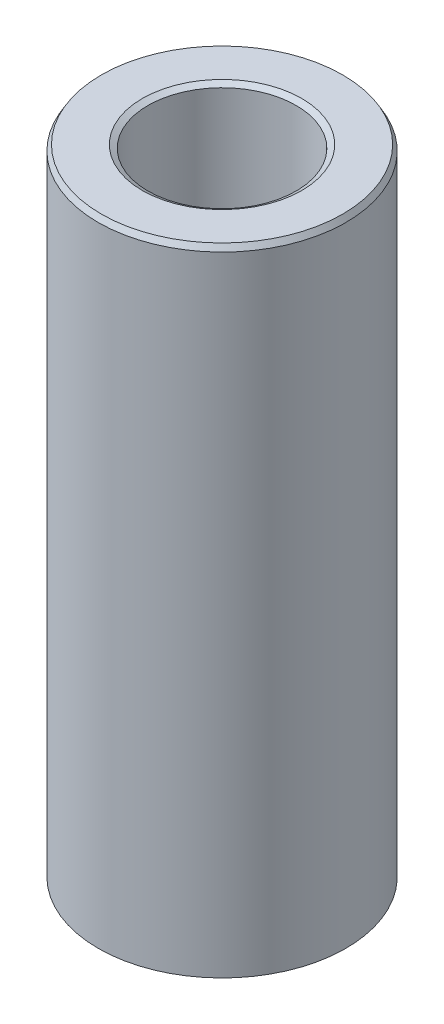
ISO-10303-21;
HEADER;
FILE_DESCRIPTION(('STEP AP214'),'2;1');
FILE_NAME('part.step','',(''),(''),'','','');
FILE_SCHEMA(('AUTOMOTIVE_DESIGN { 1 0 10303 214 1 1 1 1 }'));
ENDSEC;
DATA;
#1=APPLICATION_CONTEXT('core data for automotive mechanical design processes');
#2=APPLICATION_PROTOCOL_DEFINITION('international standard','automotive_design',2000,#1);
#3=PRODUCT_CONTEXT('',#1,'mechanical');
#4=PRODUCT('Part','Part','',(#3));
#5=PRODUCT_RELATED_PRODUCT_CATEGORY('part','',(#4));
#6=PRODUCT_DEFINITION_FORMATION('','',#4);
#7=PRODUCT_DEFINITION_CONTEXT('part definition',#1,'design');
#8=PRODUCT_DEFINITION('design','',#6,#7);
#9=PRODUCT_DEFINITION_SHAPE('','',#8);
#10=(LENGTH_UNIT() NAMED_UNIT(*) SI_UNIT(.MILLI.,.METRE.));
#11=(NAMED_UNIT(*) PLANE_ANGLE_UNIT() SI_UNIT($,.RADIAN.));
#12=(NAMED_UNIT(*) SI_UNIT($,.STERADIAN.) SOLID_ANGLE_UNIT());
#13=UNCERTAINTY_MEASURE_WITH_UNIT(LENGTH_MEASURE(1.E-05),#10,'distance_accuracy_value','');
#14=(GEOMETRIC_REPRESENTATION_CONTEXT(3) GLOBAL_UNCERTAINTY_ASSIGNED_CONTEXT((#13)) GLOBAL_UNIT_ASSIGNED_CONTEXT((#10,
#11,#12)) REPRESENTATION_CONTEXT('',''));
#15=CARTESIAN_POINT('',(0.,0.,0.));
#16=DIRECTION('',(0.,0.,1.));
#17=DIRECTION('',(1.,0.,0.));
#18=AXIS2_PLACEMENT_3D('',#15,#16,#17);
#19=CARTESIAN_POINT('',(0.,283.047277922289,0.));
#20=DIRECTION('',(0.,-1.,0.));
#21=DIRECTION('',(0.,0.,-1.));
#22=AXIS2_PLACEMENT_3D('',#19,#20,#21);
#23=CYLINDRICAL_SURFACE('',#22,55.);
#24=CARTESIAN_POINT('',(0.,1.43527825450562,0.));
#25=DIRECTION('',(0.,1.,0.));
#26=DIRECTION('',(0.,0.,1.));
#27=AXIS2_PLACEMENT_3D('',#24,#25,#26);
#28=CIRCLE('',#27,55.);
#29=CARTESIAN_POINT('',(0.,1.43527825450562,55.));
#30=VERTEX_POINT('',#29);
#31=EDGE_CURVE('E10',#30,#30,#28,.T.);
#32=ORIENTED_EDGE('',*,*,#31,.T.);
#33=EDGE_LOOP('',(#32));
#34=FACE_BOUND('',#33,.T.);
#35=CARTESIAN_POINT('',(0.,280.561303062487,0.));
#36=DIRECTION('',(0.,1.,0.));
#37=DIRECTION('',(0.,0.,1.));
#38=AXIS2_PLACEMENT_3D('',#35,#36,#37);
#39=CIRCLE('',#38,55.);
#40=CARTESIAN_POINT('',(0.,280.561303062487,55.));
#41=VERTEX_POINT('',#40);
#42=EDGE_CURVE('E50',#41,#41,#39,.F.);
#43=ORIENTED_EDGE('',*,*,#42,.T.);
#44=EDGE_LOOP('',(#43));
#45=FACE_BOUND('',#44,.T.);
#46=ADVANCED_FACE('F39',(#34,#45),#23,.T.);
#47=CARTESIAN_POINT('',(0.,283.047277922289,0.));
#48=DIRECTION('',(0.,1.,0.));
#49=DIRECTION('',(0.,0.,1.));
#50=AXIS2_PLACEMENT_3D('',#47,#48,#49);
#51=PLANE('',#50);
#52=CARTESIAN_POINT('',(0.,283.047277922289,0.));
#53=DIRECTION('',(0.,1.,0.));
#54=DIRECTION('',(0.,0.,1.));
#55=AXIS2_PLACEMENT_3D('',#52,#53,#54);
#56=CIRCLE('',#55,35.4029244100567);
#57=CARTESIAN_POINT('',(0.,283.047277922289,35.4029244100567));
#58=VERTEX_POINT('',#57);
#59=EDGE_CURVE('E58',#58,#58,#56,.F.);
#60=ORIENTED_EDGE('',*,*,#59,.T.);
#61=EDGE_LOOP('',(#60));
#62=FACE_BOUND('',#61,.T.);
#63=CARTESIAN_POINT('',(0.,283.047277922289,0.));
#64=DIRECTION('',(0.,1.,0.));
#65=DIRECTION('',(0.,0.,1.));
#66=AXIS2_PLACEMENT_3D('',#63,#64,#65);
#67=CIRCLE('',#66,53.5647217454943);
#68=CARTESIAN_POINT('',(0.,283.047277922289,53.5647217454943));
#69=VERTEX_POINT('',#68);
#70=EDGE_CURVE('E61',#69,#69,#67,.T.);
#71=ORIENTED_EDGE('',*,*,#70,.T.);
#72=EDGE_LOOP('',(#71));
#73=FACE_BOUND('',#72,.T.);
#74=ADVANCED_FACE('F88',(#62,#73),#51,.T.);
#75=CARTESIAN_POINT('',(0.,0.,0.));
#76=DIRECTION('',(0.,1.,0.));
#77=DIRECTION('',(0.,0.,1.));
#78=AXIS2_PLACEMENT_3D('',#75,#76,#77);
#79=PLANE('',#78);
#80=CARTESIAN_POINT('',(0.,0.,0.));
#81=DIRECTION('',(0.,1.,0.));
#82=DIRECTION('',(0.,0.,1.));
#83=AXIS2_PLACEMENT_3D('',#80,#81,#82);
#84=CIRCLE('',#83,34.3522278047597);
#85=CARTESIAN_POINT('',(0.,0.,34.3522278047597));
#86=VERTEX_POINT('',#85);
#87=EDGE_CURVE('E51',#86,#86,#84,.T.);
#88=ORIENTED_EDGE('',*,*,#87,.T.);
#89=EDGE_LOOP('',(#88));
#90=FACE_BOUND('',#89,.T.);
#91=CARTESIAN_POINT('',(0.,0.,0.));
#92=DIRECTION('',(0.,1.,0.));
#93=DIRECTION('',(0.,0.,1.));
#94=AXIS2_PLACEMENT_3D('',#91,#92,#93);
#95=CIRCLE('',#94,52.5140251401974);
#96=CARTESIAN_POINT('',(0.,0.,52.5140251401974));
#97=VERTEX_POINT('',#96);
#98=EDGE_CURVE('E54',#97,#97,#95,.F.);
#99=ORIENTED_EDGE('',*,*,#98,.T.);
#100=EDGE_LOOP('',(#99));
#101=FACE_BOUND('',#100,.T.);
#102=ADVANCED_FACE('F83',(#90,#101),#79,.F.);
#103=CARTESIAN_POINT('',(0.,283.047277922289,0.));
#104=DIRECTION('',(0.,-1.,0.));
#105=DIRECTION('',(0.,0.,-1.));
#106=AXIS2_PLACEMENT_3D('',#103,#104,#105);
#107=CYLINDRICAL_SURFACE('',#106,32.9169495502541);
#108=CARTESIAN_POINT('',(0.,281.611999667784,0.));
#109=DIRECTION('',(0.,1.,0.));
#110=DIRECTION('',(0.,0.,1.));
#111=AXIS2_PLACEMENT_3D('',#108,#109,#110);
#112=CIRCLE('',#111,32.9169495502541);
#113=CARTESIAN_POINT('',(0.,281.611999667784,32.9169495502541));
#114=VERTEX_POINT('',#113);
#115=EDGE_CURVE('E67',#114,#114,#112,.T.);
#116=ORIENTED_EDGE('',*,*,#115,.T.);
#117=EDGE_LOOP('',(#116));
#118=FACE_BOUND('',#117,.T.);
#119=CARTESIAN_POINT('',(0.,2.48597485980256,0.));
#120=DIRECTION('',(0.,1.,0.));
#121=DIRECTION('',(0.,0.,1.));
#122=AXIS2_PLACEMENT_3D('',#119,#120,#121);
#123=CIRCLE('',#122,32.9169495502541);
#124=CARTESIAN_POINT('',(0.,2.48597485980256,32.9169495502541));
#125=VERTEX_POINT('',#124);
#126=EDGE_CURVE('E69',#125,#125,#123,.F.);
#127=ORIENTED_EDGE('',*,*,#126,.T.);
#128=EDGE_LOOP('',(#127));
#129=FACE_BOUND('',#128,.T.);
#130=ADVANCED_FACE('F71',(#118,#129),#107,.F.);
#131=CARTESIAN_POINT('',(0.,281.611999667784,0.));
#132=DIRECTION('',(0.,1.,0.));
#133=DIRECTION('',(0.,0.,1.));
#134=AXIS2_PLACEMENT_3D('',#131,#132,#133);
#135=CONICAL_SURFACE('',#134,32.9169495502541,1.04719755119659);
#136=ORIENTED_EDGE('',*,*,#59,.F.);
#137=EDGE_LOOP('',(#136));
#138=FACE_BOUND('',#137,.T.);
#139=ORIENTED_EDGE('',*,*,#115,.F.);
#140=EDGE_LOOP('',(#139));
#141=FACE_BOUND('',#140,.T.);
#142=ADVANCED_FACE('F77',(#138,#141),#135,.F.);
#143=CARTESIAN_POINT('',(0.,0.,0.));
#144=DIRECTION('',(0.,-1.,0.));
#145=DIRECTION('',(0.,0.,-1.));
#146=AXIS2_PLACEMENT_3D('',#143,#144,#145);
#147=CONICAL_SURFACE('',#146,34.3522278047597,0.523598775598296);
#148=ORIENTED_EDGE('',*,*,#126,.F.);
#149=EDGE_LOOP('',(#148));
#150=FACE_BOUND('',#149,.T.);
#151=ORIENTED_EDGE('',*,*,#87,.F.);
#152=EDGE_LOOP('',(#151));
#153=FACE_BOUND('',#152,.T.);
#154=ADVANCED_FACE('F73',(#150,#153),#147,.F.);
#155=CARTESIAN_POINT('',(0.,1.43527825450562,0.));
#156=DIRECTION('',(0.,1.,0.));
#157=DIRECTION('',(0.,0.,1.));
#158=AXIS2_PLACEMENT_3D('',#155,#156,#157);
#159=CONICAL_SURFACE('',#158,55.,1.0471975511966);
#160=ORIENTED_EDGE('',*,*,#98,.F.);
#161=EDGE_LOOP('',(#160));
#162=FACE_BOUND('',#161,.T.);
#163=ORIENTED_EDGE('',*,*,#31,.F.);
#164=EDGE_LOOP('',(#163));
#165=FACE_BOUND('',#164,.T.);
#166=ADVANCED_FACE('F76',(#162,#165),#159,.T.);
#167=CARTESIAN_POINT('',(0.,283.047277922289,0.));
#168=DIRECTION('',(0.,-1.,0.));
#169=DIRECTION('',(0.,0.,-1.));
#170=AXIS2_PLACEMENT_3D('',#167,#168,#169);
#171=CONICAL_SURFACE('',#170,53.5647217454943,0.523598775598289);
#172=ORIENTED_EDGE('',*,*,#42,.F.);
#173=EDGE_LOOP('',(#172));
#174=FACE_BOUND('',#173,.T.);
#175=ORIENTED_EDGE('',*,*,#70,.F.);
#176=EDGE_LOOP('',(#175));
#177=FACE_BOUND('',#176,.T.);
#178=ADVANCED_FACE('F45',(#174,#177),#171,.T.);
#179=CLOSED_SHELL('',(#46,#74,#102,#130,#142,#154,#166,#178));
#180=MANIFOLD_SOLID_BREP('B2',#179);
#181=ADVANCED_BREP_SHAPE_REPRESENTATION('',(#18,#180),#14);
#182=SHAPE_DEFINITION_REPRESENTATION(#9,#181);
ENDSEC;
END-ISO-10303-21;
